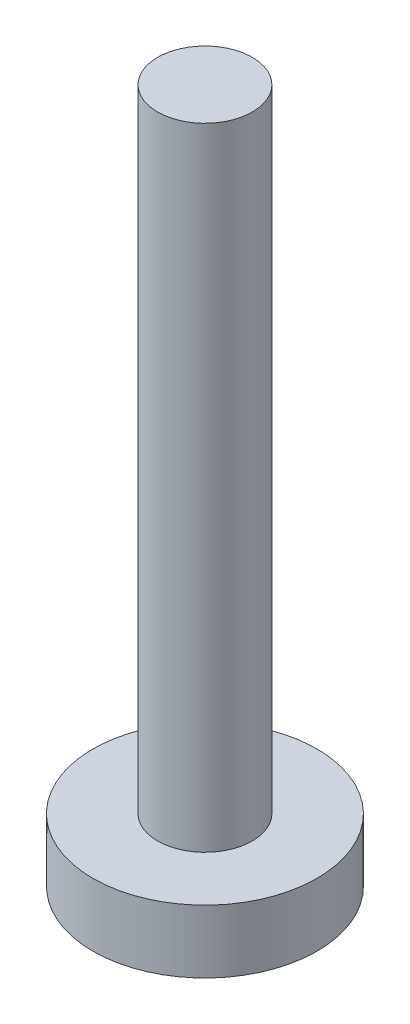
ISO-10303-21;
HEADER;
FILE_DESCRIPTION(('STEP AP214'),'2;1');
FILE_NAME('part.step','',(''),(''),'','','');
FILE_SCHEMA(('AUTOMOTIVE_DESIGN { 1 0 10303 214 1 1 1 1 }'));
ENDSEC;
DATA;
#1=APPLICATION_CONTEXT('core data for automotive mechanical design processes');
#2=APPLICATION_PROTOCOL_DEFINITION('international standard','automotive_design',2000,#1);
#3=PRODUCT_CONTEXT('',#1,'mechanical');
#4=PRODUCT('Part','Part','',(#3));
#5=PRODUCT_RELATED_PRODUCT_CATEGORY('part','',(#4));
#6=PRODUCT_DEFINITION_FORMATION('','',#4);
#7=PRODUCT_DEFINITION_CONTEXT('part definition',#1,'design');
#8=PRODUCT_DEFINITION('design','',#6,#7);
#9=PRODUCT_DEFINITION_SHAPE('','',#8);
#10=(LENGTH_UNIT() NAMED_UNIT(*) SI_UNIT(.MILLI.,.METRE.));
#11=(NAMED_UNIT(*) PLANE_ANGLE_UNIT() SI_UNIT($,.RADIAN.));
#12=(NAMED_UNIT(*) SI_UNIT($,.STERADIAN.) SOLID_ANGLE_UNIT());
#13=UNCERTAINTY_MEASURE_WITH_UNIT(LENGTH_MEASURE(1.E-05),#10,'distance_accuracy_value','');
#14=(GEOMETRIC_REPRESENTATION_CONTEXT(3) GLOBAL_UNCERTAINTY_ASSIGNED_CONTEXT((#13)) GLOBAL_UNIT_ASSIGNED_CONTEXT((#10,
#11,#12)) REPRESENTATION_CONTEXT('',''));
#15=CARTESIAN_POINT('',(0.,0.,0.));
#16=DIRECTION('',(0.,0.,1.));
#17=DIRECTION('',(1.,0.,0.));
#18=AXIS2_PLACEMENT_3D('',#15,#16,#17);
#19=CARTESIAN_POINT('',(0.,2.,0.));
#20=DIRECTION('',(0.,-1.,0.));
#21=DIRECTION('',(0.,0.,-1.));
#22=AXIS2_PLACEMENT_3D('',#19,#20,#21);
#23=CYLINDRICAL_SURFACE('',#22,3.55);
#24=CARTESIAN_POINT('',(0.,2.,0.));
#25=DIRECTION('',(0.,1.,0.));
#26=DIRECTION('',(0.,0.,1.));
#27=AXIS2_PLACEMENT_3D('',#24,#25,#26);
#28=CIRCLE('',#27,3.55);
#29=CARTESIAN_POINT('',(0.,2.,3.55));
#30=VERTEX_POINT('',#29);
#31=EDGE_CURVE('E10',#30,#30,#28,.T.);
#32=ORIENTED_EDGE('',*,*,#31,.F.);
#33=EDGE_LOOP('',(#32));
#34=FACE_BOUND('',#33,.T.);
#35=CARTESIAN_POINT('',(0.,0.,0.));
#36=DIRECTION('',(0.,1.,0.));
#37=DIRECTION('',(0.,0.,1.));
#38=AXIS2_PLACEMENT_3D('',#35,#36,#37);
#39=CIRCLE('',#38,3.55);
#40=CARTESIAN_POINT('',(0.,0.,3.55));
#41=VERTEX_POINT('',#40);
#42=EDGE_CURVE('E38',#41,#41,#39,.T.);
#43=ORIENTED_EDGE('',*,*,#42,.T.);
#44=EDGE_LOOP('',(#43));
#45=FACE_BOUND('',#44,.T.);
#46=ADVANCED_FACE('F35',(#34,#45),#23,.T.);
#47=CARTESIAN_POINT('',(0.,2.,0.));
#48=DIRECTION('',(0.,1.,0.));
#49=DIRECTION('',(0.,0.,1.));
#50=AXIS2_PLACEMENT_3D('',#47,#48,#49);
#51=PLANE('',#50);
#52=CARTESIAN_POINT('',(0.,2.,0.));
#53=DIRECTION('',(0.,1.,0.));
#54=DIRECTION('',(0.,0.,1.));
#55=AXIS2_PLACEMENT_3D('',#52,#53,#54);
#56=CIRCLE('',#55,1.5);
#57=CARTESIAN_POINT('',(0.,2.,1.5));
#58=VERTEX_POINT('',#57);
#59=EDGE_CURVE('E47',#58,#58,#56,.T.);
#60=ORIENTED_EDGE('',*,*,#59,.F.);
#61=EDGE_LOOP('',(#60));
#62=FACE_BOUND('',#61,.T.);
#63=ORIENTED_EDGE('',*,*,#31,.T.);
#64=EDGE_LOOP('',(#63));
#65=FACE_BOUND('',#64,.T.);
#66=ADVANCED_FACE('F62',(#62,#65),#51,.T.);
#67=CARTESIAN_POINT('',(0.,0.,0.));
#68=DIRECTION('',(0.,1.,0.));
#69=DIRECTION('',(0.,0.,1.));
#70=AXIS2_PLACEMENT_3D('',#67,#68,#69);
#71=PLANE('',#70);
#72=ORIENTED_EDGE('',*,*,#42,.F.);
#73=EDGE_LOOP('',(#72));
#74=FACE_BOUND('',#73,.T.);
#75=ADVANCED_FACE('F58',(#74),#71,.F.);
#76=CARTESIAN_POINT('',(0.,22.,0.));
#77=DIRECTION('',(0.,-1.,0.));
#78=DIRECTION('',(0.,0.,-1.));
#79=AXIS2_PLACEMENT_3D('',#76,#77,#78);
#80=CYLINDRICAL_SURFACE('',#79,1.5);
#81=CARTESIAN_POINT('',(0.,22.,0.));
#82=DIRECTION('',(0.,1.,0.));
#83=DIRECTION('',(0.,0.,1.));
#84=AXIS2_PLACEMENT_3D('',#81,#82,#83);
#85=CIRCLE('',#84,1.5);
#86=CARTESIAN_POINT('',(0.,22.,1.5));
#87=VERTEX_POINT('',#86);
#88=EDGE_CURVE('E45',#87,#87,#85,.T.);
#89=ORIENTED_EDGE('',*,*,#88,.F.);
#90=EDGE_LOOP('',(#89));
#91=FACE_BOUND('',#90,.T.);
#92=ORIENTED_EDGE('',*,*,#59,.T.);
#93=EDGE_LOOP('',(#92));
#94=FACE_BOUND('',#93,.T.);
#95=ADVANCED_FACE('F55',(#91,#94),#80,.T.);
#96=CARTESIAN_POINT('',(0.,22.,0.));
#97=DIRECTION('',(0.,1.,0.));
#98=DIRECTION('',(0.,0.,1.));
#99=AXIS2_PLACEMENT_3D('',#96,#97,#98);
#100=PLANE('',#99);
#101=ORIENTED_EDGE('',*,*,#88,.T.);
#102=EDGE_LOOP('',(#101));
#103=FACE_BOUND('',#102,.T.);
#104=ADVANCED_FACE('F53',(#103),#100,.T.);
#105=CLOSED_SHELL('',(#46,#66,#75,#95,#104));
#106=MANIFOLD_SOLID_BREP('B2',#105);
#107=ADVANCED_BREP_SHAPE_REPRESENTATION('',(#18,#106),#14);
#108=SHAPE_DEFINITION_REPRESENTATION(#9,#107);
ENDSEC;
END-ISO-10303-21;
